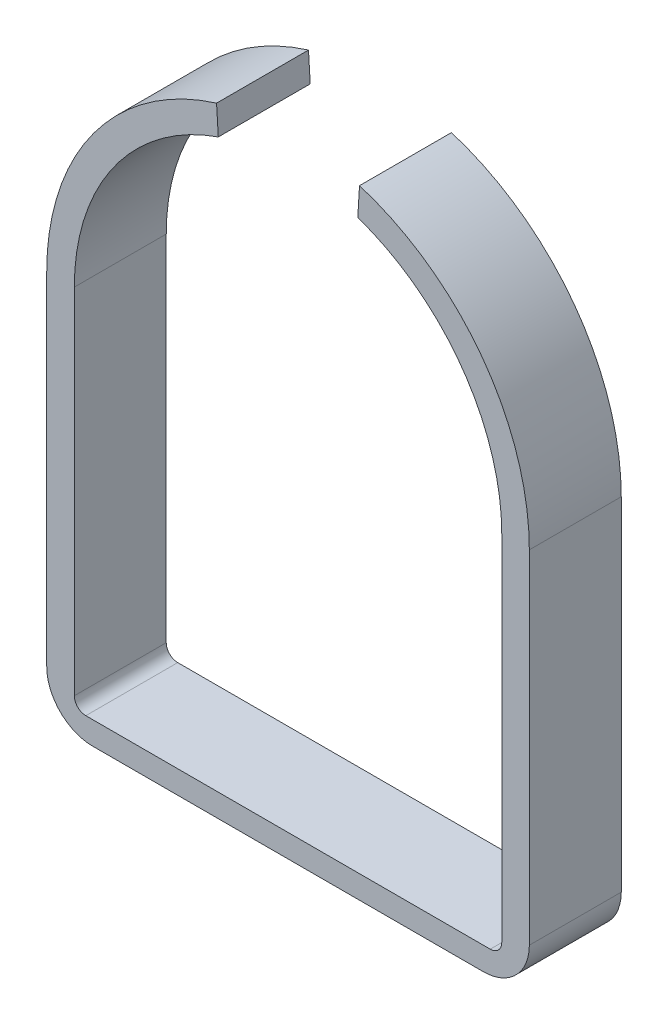
ISO-10303-21;
HEADER;
FILE_DESCRIPTION(('STEP AP214'),'2;1');
FILE_NAME('part.step','',(''),(''),'','','');
FILE_SCHEMA(('AUTOMOTIVE_DESIGN { 1 0 10303 214 1 1 1 1 }'));
ENDSEC;
DATA;
#1=APPLICATION_CONTEXT('core data for automotive mechanical design processes');
#2=APPLICATION_PROTOCOL_DEFINITION('international standard','automotive_design',2000,#1);
#3=PRODUCT_CONTEXT('',#1,'mechanical');
#4=PRODUCT('Part','Part','',(#3));
#5=PRODUCT_RELATED_PRODUCT_CATEGORY('part','',(#4));
#6=PRODUCT_DEFINITION_FORMATION('','',#4);
#7=PRODUCT_DEFINITION_CONTEXT('part definition',#1,'design');
#8=PRODUCT_DEFINITION('design','',#6,#7);
#9=PRODUCT_DEFINITION_SHAPE('','',#8);
#10=(LENGTH_UNIT() NAMED_UNIT(*) SI_UNIT(.MILLI.,.METRE.));
#11=(NAMED_UNIT(*) PLANE_ANGLE_UNIT() SI_UNIT($,.RADIAN.));
#12=(NAMED_UNIT(*) SI_UNIT($,.STERADIAN.) SOLID_ANGLE_UNIT());
#13=UNCERTAINTY_MEASURE_WITH_UNIT(LENGTH_MEASURE(1.E-05),#10,'distance_accuracy_value','');
#14=(GEOMETRIC_REPRESENTATION_CONTEXT(3) GLOBAL_UNCERTAINTY_ASSIGNED_CONTEXT((#13)) GLOBAL_UNIT_ASSIGNED_CONTEXT((#10,
#11,#12)) REPRESENTATION_CONTEXT('',''));
#15=CARTESIAN_POINT('',(0.,0.,0.));
#16=DIRECTION('',(0.,0.,1.));
#17=DIRECTION('',(1.,0.,0.));
#18=AXIS2_PLACEMENT_3D('',#15,#16,#17);
#19=CARTESIAN_POINT('',(0.,0.,56.8469714478884));
#20=DIRECTION('',(0.,0.,-1.));
#21=DIRECTION('',(-1.,0.,0.));
#22=AXIS2_PLACEMENT_3D('',#19,#20,#21);
#23=CYLINDRICAL_SURFACE('',#22,9.3);
#24=DIRECTION('',(0.,0.,-1.));
#25=VECTOR('',#24,1.);
#26=CARTESIAN_POINT('',(3.03467311666204,8.79094756411439,56.8469714478884));
#27=LINE('',#26,#25);
#28=CARTESIAN_POINT('',(3.03467311666204,8.79094756411439,1.5));
#29=VERTEX_POINT('',#28);
#30=CARTESIAN_POINT('',(3.03467311666204,8.79094756411439,5.5));
#31=VERTEX_POINT('',#30);
#32=EDGE_CURVE('E222',#29,#31,#27,.F.);
#33=ORIENTED_EDGE('',*,*,#32,.F.);
#34=CARTESIAN_POINT('',(0.,0.,1.5));
#35=DIRECTION('',(0.,0.,1.));
#36=DIRECTION('',(-1.,0.,0.));
#37=AXIS2_PLACEMENT_3D('',#34,#35,#36);
#38=CIRCLE('',#37,9.3);
#39=CARTESIAN_POINT('',(9.3,0.,1.5));
#40=VERTEX_POINT('',#39);
#41=EDGE_CURVE('E209',#40,#29,#38,.T.);
#42=ORIENTED_EDGE('',*,*,#41,.F.);
#43=DIRECTION('',(0.,0.,-1.));
#44=VECTOR('',#43,1.);
#45=CARTESIAN_POINT('',(9.3,0.,56.8469714478884));
#46=LINE('',#45,#44);
#47=CARTESIAN_POINT('',(9.3,0.,5.5));
#48=VERTEX_POINT('',#47);
#49=EDGE_CURVE('E270',#48,#40,#46,.T.);
#50=ORIENTED_EDGE('',*,*,#49,.F.);
#51=CARTESIAN_POINT('',(0.,0.,5.5));
#52=DIRECTION('',(0.,0.,1.));
#53=DIRECTION('',(1.,0.,0.));
#54=AXIS2_PLACEMENT_3D('',#51,#52,#53);
#55=CIRCLE('',#54,9.3);
#56=EDGE_CURVE('E235',#48,#31,#55,.T.);
#57=ORIENTED_EDGE('',*,*,#56,.T.);
#58=EDGE_LOOP('',(#33,#42,#50,#57));
#59=FACE_BOUND('',#58,.T.);
#60=ADVANCED_FACE('F48',(#59),#23,.F.);
#61=CARTESIAN_POINT('',(0.,0.,5.5));
#62=DIRECTION('',(0.,0.,1.));
#63=DIRECTION('',(1.,0.,0.));
#64=AXIS2_PLACEMENT_3D('',#61,#62,#63);
#65=PLANE('',#64);
#66=DIRECTION('',(0.,-1.,0.));
#67=VECTOR('',#66,1.);
#68=CARTESIAN_POINT('',(-10.5,0.,5.5));
#69=LINE('',#68,#67);
#70=CARTESIAN_POINT('',(-10.5,0.,5.5));
#71=VERTEX_POINT('',#70);
#72=CARTESIAN_POINT('',(-10.5,-14.900343897342,5.5));
#73=VERTEX_POINT('',#72);
#74=EDGE_CURVE('E178',#71,#73,#69,.T.);
#75=ORIENTED_EDGE('',*,*,#74,.T.);
#76=CARTESIAN_POINT('',(-8.5,-14.900343897342,5.5));
#77=DIRECTION('',(0.,0.,1.));
#78=DIRECTION('',(1.,0.,0.));
#79=AXIS2_PLACEMENT_3D('',#76,#77,#78);
#80=CIRCLE('',#79,2.);
#81=CARTESIAN_POINT('',(-8.5,-16.900343897342,5.5));
#82=VERTEX_POINT('',#81);
#83=EDGE_CURVE('E278',#73,#82,#80,.T.);
#84=ORIENTED_EDGE('',*,*,#83,.T.);
#85=DIRECTION('',(-1.,0.,0.));
#86=VECTOR('',#85,1.);
#87=CARTESIAN_POINT('',(-11.1726993556512,-16.900343897342,5.5));
#88=LINE('',#87,#86);
#89=CARTESIAN_POINT('',(8.5,-16.900343897342,5.5));
#90=VERTEX_POINT('',#89);
#91=EDGE_CURVE('E172',#90,#82,#88,.T.);
#92=ORIENTED_EDGE('',*,*,#91,.F.);
#93=CARTESIAN_POINT('',(8.5,-14.900343897342,5.5));
#94=DIRECTION('',(0.,0.,1.));
#95=DIRECTION('',(1.,0.,0.));
#96=AXIS2_PLACEMENT_3D('',#93,#94,#95);
#97=CIRCLE('',#96,2.);
#98=CARTESIAN_POINT('',(10.5,-14.900343897342,5.5));
#99=VERTEX_POINT('',#98);
#100=EDGE_CURVE('E276',#90,#99,#97,.T.);
#101=ORIENTED_EDGE('',*,*,#100,.T.);
#102=DIRECTION('',(0.,-1.,0.));
#103=VECTOR('',#102,1.);
#104=CARTESIAN_POINT('',(10.5,0.,5.5));
#105=LINE('',#104,#103);
#106=CARTESIAN_POINT('',(10.5,0.,5.5));
#107=VERTEX_POINT('',#106);
#108=EDGE_CURVE('E239',#107,#99,#105,.T.);
#109=ORIENTED_EDGE('',*,*,#108,.F.);
#110=CARTESIAN_POINT('',(0.,0.,5.5));
#111=DIRECTION('',(0.,0.,1.));
#112=DIRECTION('',(1.,0.,0.));
#113=AXIS2_PLACEMENT_3D('',#110,#111,#112);
#114=CIRCLE('',#113,10.5);
#115=CARTESIAN_POINT('',(3.11032664956738,10.0287520725657,5.5));
#116=VERTEX_POINT('',#115);
#117=EDGE_CURVE('E241',#116,#107,#114,.F.);
#118=ORIENTED_EDGE('',*,*,#117,.F.);
#119=DIRECTION('',(-0.0610052906976046,-0.998137442693591,0.));
#120=VECTOR('',#119,1.);
#121=CARTESIAN_POINT('',(2.48808370636675,-0.15206950796001,5.5));
#122=LINE('',#121,#120);
#123=EDGE_CURVE('E246',#116,#31,#122,.T.);
#124=ORIENTED_EDGE('',*,*,#123,.T.);
#125=ORIENTED_EDGE('',*,*,#56,.F.);
#126=DIRECTION('',(0.,1.,0.));
#127=VECTOR('',#126,1.);
#128=CARTESIAN_POINT('',(9.3,0.,5.5));
#129=LINE('',#128,#127);
#130=CARTESIAN_POINT('',(9.3,-15.4,5.5));
#131=VERTEX_POINT('',#130);
#132=EDGE_CURVE('E233',#131,#48,#129,.T.);
#133=ORIENTED_EDGE('',*,*,#132,.F.);
#134=CARTESIAN_POINT('',(8.8,-15.4,5.5));
#135=DIRECTION('',(0.,0.,1.));
#136=DIRECTION('',(1.,0.,0.));
#137=AXIS2_PLACEMENT_3D('',#134,#135,#136);
#138=CIRCLE('',#137,0.5);
#139=CARTESIAN_POINT('',(8.8,-15.9,5.5));
#140=VERTEX_POINT('',#139);
#141=EDGE_CURVE('E252',#131,#140,#138,.F.);
#142=ORIENTED_EDGE('',*,*,#141,.T.);
#143=DIRECTION('',(1.,0.,0.));
#144=VECTOR('',#143,1.);
#145=CARTESIAN_POINT('',(0.,-15.9,5.5));
#146=LINE('',#145,#144);
#147=CARTESIAN_POINT('',(-8.8,-15.9,5.5));
#148=VERTEX_POINT('',#147);
#149=EDGE_CURVE('E230',#148,#140,#146,.T.);
#150=ORIENTED_EDGE('',*,*,#149,.F.);
#151=CARTESIAN_POINT('',(-8.8,-15.4,5.5));
#152=DIRECTION('',(0.,0.,1.));
#153=DIRECTION('',(1.,0.,0.));
#154=AXIS2_PLACEMENT_3D('',#151,#152,#153);
#155=CIRCLE('',#154,0.5);
#156=CARTESIAN_POINT('',(-9.3,-15.4,5.5));
#157=VERTEX_POINT('',#156);
#158=EDGE_CURVE('E225',#148,#157,#155,.F.);
#159=ORIENTED_EDGE('',*,*,#158,.T.);
#160=DIRECTION('',(0.,-1.,0.));
#161=VECTOR('',#160,1.);
#162=CARTESIAN_POINT('',(-9.3,-15.9,5.5));
#163=LINE('',#162,#161);
#164=CARTESIAN_POINT('',(-9.3,0.,5.5));
#165=VERTEX_POINT('',#164);
#166=EDGE_CURVE('E226',#165,#157,#163,.T.);
#167=ORIENTED_EDGE('',*,*,#166,.F.);
#168=CARTESIAN_POINT('',(-3.03467311644218,8.79094756419029,5.5));
#169=VERTEX_POINT('',#168);
#170=EDGE_CURVE('E238',#169,#165,#55,.T.);
#171=ORIENTED_EDGE('',*,*,#170,.F.);
#172=DIRECTION('',(-0.0610052909139107,0.99813744268037,0.));
#173=VECTOR('',#172,1.);
#174=CARTESIAN_POINT('',(-2.48808370417207,-0.152069508367079,5.5));
#175=LINE('',#174,#173);
#176=CARTESIAN_POINT('',(-3.11032664961128,10.0287520725521,5.5));
#177=VERTEX_POINT('',#176);
#178=EDGE_CURVE('E248',#169,#177,#175,.T.);
#179=ORIENTED_EDGE('',*,*,#178,.T.);
#180=CARTESIAN_POINT('',(0.,0.,5.5));
#181=DIRECTION('',(0.,0.,1.));
#182=DIRECTION('',(1.,0.,0.));
#183=AXIS2_PLACEMENT_3D('',#180,#181,#182);
#184=CIRCLE('',#183,10.5);
#185=EDGE_CURVE('E244',#71,#177,#184,.F.);
#186=ORIENTED_EDGE('',*,*,#185,.F.);
#187=EDGE_LOOP('',(#75,#84,#92,#101,#109,#118,#124,#125,#133,#142,#150,#159,#167,#171,#179,#186));
#188=FACE_BOUND('',#187,.T.);
#189=ADVANCED_FACE('F294',(#188),#65,.T.);
#190=DIRECTION('',(0.,0.,-1.));
#191=VECTOR('',#190,1.);
#192=CARTESIAN_POINT('',(-3.03467311644218,8.79094756419029,56.8469714478884));
#193=LINE('',#192,#191);
#194=CARTESIAN_POINT('',(-3.03467311644218,8.79094756419029,1.5));
#195=VERTEX_POINT('',#194);
#196=EDGE_CURVE('E220',#169,#195,#193,.T.);
#197=ORIENTED_EDGE('',*,*,#196,.F.);
#198=ORIENTED_EDGE('',*,*,#170,.T.);
#199=DIRECTION('',(0.,0.,-1.));
#200=VECTOR('',#199,1.);
#201=CARTESIAN_POINT('',(-9.3,0.,56.8469714478884));
#202=LINE('',#201,#200);
#203=CARTESIAN_POINT('',(-9.3,0.,1.5));
#204=VERTEX_POINT('',#203);
#205=EDGE_CURVE('E182',#165,#204,#202,.T.);
#206=ORIENTED_EDGE('',*,*,#205,.T.);
#207=CARTESIAN_POINT('',(0.,0.,1.5));
#208=DIRECTION('',(0.,0.,1.));
#209=DIRECTION('',(-1.,0.,0.));
#210=AXIS2_PLACEMENT_3D('',#207,#208,#209);
#211=CIRCLE('',#210,9.3);
#212=EDGE_CURVE('E188',#195,#204,#211,.T.);
#213=ORIENTED_EDGE('',*,*,#212,.F.);
#214=EDGE_LOOP('',(#197,#198,#206,#213));
#215=FACE_BOUND('',#214,.T.);
#216=ADVANCED_FACE('F302',(#215),#23,.F.);
#217=CARTESIAN_POINT('',(-9.3,-15.9,56.8469714478884));
#218=DIRECTION('',(1.,0.,0.));
#219=DIRECTION('',(0.,0.,-1.));
#220=AXIS2_PLACEMENT_3D('',#217,#218,#219);
#221=PLANE('',#220);
#222=DIRECTION('',(0.,0.,-1.));
#223=VECTOR('',#222,1.);
#224=CARTESIAN_POINT('',(-9.3,-15.4,0.));
#225=LINE('',#224,#223);
#226=CARTESIAN_POINT('',(-9.3,-15.4,1.5));
#227=VERTEX_POINT('',#226);
#228=EDGE_CURVE('E229',#157,#227,#225,.T.);
#229=ORIENTED_EDGE('',*,*,#228,.T.);
#230=DIRECTION('',(0.,-1.,0.));
#231=VECTOR('',#230,1.);
#232=CARTESIAN_POINT('',(-9.3,0.,1.5));
#233=LINE('',#232,#231);
#234=EDGE_CURVE('E194',#204,#227,#233,.T.);
#235=ORIENTED_EDGE('',*,*,#234,.F.);
#236=ORIENTED_EDGE('',*,*,#205,.F.);
#237=ORIENTED_EDGE('',*,*,#166,.T.);
#238=EDGE_LOOP('',(#229,#235,#236,#237));
#239=FACE_BOUND('',#238,.T.);
#240=ADVANCED_FACE('F307',(#239),#221,.T.);
#241=CARTESIAN_POINT('',(0.,-15.9,56.8469714478884));
#242=DIRECTION('',(0.,1.,0.));
#243=DIRECTION('',(0.,0.,1.));
#244=AXIS2_PLACEMENT_3D('',#241,#242,#243);
#245=PLANE('',#244);
#246=DIRECTION('',(0.,0.,-1.));
#247=VECTOR('',#246,1.);
#248=CARTESIAN_POINT('',(8.8,-15.9,0.));
#249=LINE('',#248,#247);
#250=CARTESIAN_POINT('',(8.8,-15.9,1.5));
#251=VERTEX_POINT('',#250);
#252=EDGE_CURVE('E260',#140,#251,#249,.T.);
#253=ORIENTED_EDGE('',*,*,#252,.T.);
#254=DIRECTION('',(1.,0.,0.));
#255=VECTOR('',#254,1.);
#256=CARTESIAN_POINT('',(-8.8,-15.9,1.5));
#257=LINE('',#256,#255);
#258=CARTESIAN_POINT('',(-8.8,-15.9,1.5));
#259=VERTEX_POINT('',#258);
#260=EDGE_CURVE('E200',#259,#251,#257,.T.);
#261=ORIENTED_EDGE('',*,*,#260,.F.);
#262=DIRECTION('',(0.,0.,-1.));
#263=VECTOR('',#262,1.);
#264=CARTESIAN_POINT('',(-8.8,-15.9,6.02159565602451));
#265=LINE('',#264,#263);
#266=EDGE_CURVE('E262',#259,#148,#265,.F.);
#267=ORIENTED_EDGE('',*,*,#266,.T.);
#268=ORIENTED_EDGE('',*,*,#149,.T.);
#269=EDGE_LOOP('',(#253,#261,#267,#268));
#270=FACE_BOUND('',#269,.T.);
#271=ADVANCED_FACE('F314',(#270),#245,.T.);
#272=CARTESIAN_POINT('',(-8.8,-15.4,56.8469714478884));
#273=DIRECTION('',(0.,0.,1.));
#274=DIRECTION('',(1.,0.,0.));
#275=AXIS2_PLACEMENT_3D('',#272,#273,#274);
#276=CYLINDRICAL_SURFACE('',#275,0.5);
#277=ORIENTED_EDGE('',*,*,#266,.F.);
#278=CARTESIAN_POINT('',(-8.8,-15.4,1.5));
#279=DIRECTION('',(0.,0.,1.));
#280=DIRECTION('',(-1.,0.,0.));
#281=AXIS2_PLACEMENT_3D('',#278,#279,#280);
#282=CIRCLE('',#281,0.5);
#283=EDGE_CURVE('E197',#227,#259,#282,.T.);
#284=ORIENTED_EDGE('',*,*,#283,.F.);
#285=ORIENTED_EDGE('',*,*,#228,.F.);
#286=ORIENTED_EDGE('',*,*,#158,.F.);
#287=EDGE_LOOP('',(#277,#284,#285,#286));
#288=FACE_BOUND('',#287,.T.);
#289=ADVANCED_FACE('F310',(#288),#276,.F.);
#290=CARTESIAN_POINT('',(9.3,0.,56.8469714478884));
#291=DIRECTION('',(-1.,0.,0.));
#292=DIRECTION('',(0.,-1.,0.));
#293=AXIS2_PLACEMENT_3D('',#290,#291,#292);
#294=PLANE('',#293);
#295=ORIENTED_EDGE('',*,*,#49,.T.);
#296=DIRECTION('',(0.,1.,0.));
#297=VECTOR('',#296,1.);
#298=CARTESIAN_POINT('',(9.3,-15.4,1.5));
#299=LINE('',#298,#297);
#300=CARTESIAN_POINT('',(9.3,-15.4,1.5));
#301=VERTEX_POINT('',#300);
#302=EDGE_CURVE('E206',#301,#40,#299,.T.);
#303=ORIENTED_EDGE('',*,*,#302,.F.);
#304=DIRECTION('',(0.,0.,-1.));
#305=VECTOR('',#304,1.);
#306=CARTESIAN_POINT('',(9.3,-15.4,6.0215956560245));
#307=LINE('',#306,#305);
#308=EDGE_CURVE('E258',#301,#131,#307,.F.);
#309=ORIENTED_EDGE('',*,*,#308,.T.);
#310=ORIENTED_EDGE('',*,*,#132,.T.);
#311=EDGE_LOOP('',(#295,#303,#309,#310));
#312=FACE_BOUND('',#311,.T.);
#313=ADVANCED_FACE('F322',(#312),#294,.T.);
#314=CARTESIAN_POINT('',(8.8,-15.4,56.8469714478884));
#315=DIRECTION('',(0.,0.,1.));
#316=DIRECTION('',(1.,0.,0.));
#317=AXIS2_PLACEMENT_3D('',#314,#315,#316);
#318=CYLINDRICAL_SURFACE('',#317,0.5);
#319=ORIENTED_EDGE('',*,*,#308,.F.);
#320=CARTESIAN_POINT('',(8.8,-15.4,1.5));
#321=DIRECTION('',(0.,0.,1.));
#322=DIRECTION('',(-1.,0.,0.));
#323=AXIS2_PLACEMENT_3D('',#320,#321,#322);
#324=CIRCLE('',#323,0.5);
#325=EDGE_CURVE('E203',#251,#301,#324,.T.);
#326=ORIENTED_EDGE('',*,*,#325,.F.);
#327=ORIENTED_EDGE('',*,*,#252,.F.);
#328=ORIENTED_EDGE('',*,*,#141,.F.);
#329=EDGE_LOOP('',(#319,#326,#327,#328));
#330=FACE_BOUND('',#329,.T.);
#331=ADVANCED_FACE('F318',(#330),#318,.F.);
#332=CARTESIAN_POINT('',(2.48808370636675,-0.15206950796001,7.65));
#333=DIRECTION('',(0.998137442693591,-0.0610052906976046,0.));
#334=DIRECTION('',(0.0610052906976046,0.998137442693591,0.));
#335=AXIS2_PLACEMENT_3D('',#332,#333,#334);
#336=PLANE('',#335);
#337=DIRECTION('',(0.,0.,-1.));
#338=VECTOR('',#337,1.);
#339=CARTESIAN_POINT('',(3.11032664956738,10.0287520725657,7.65));
#340=LINE('',#339,#338);
#341=CARTESIAN_POINT('',(3.11032664956738,10.0287520725657,1.5));
#342=VERTEX_POINT('',#341);
#343=EDGE_CURVE('E266',#116,#342,#340,.T.);
#344=ORIENTED_EDGE('',*,*,#343,.T.);
#345=DIRECTION('',(0.0610052906976045,0.998137442693591,0.));
#346=VECTOR('',#345,1.);
#347=CARTESIAN_POINT('',(3.03467311666204,8.79094756411439,1.5));
#348=LINE('',#347,#346);
#349=EDGE_CURVE('E212',#29,#342,#348,.T.);
#350=ORIENTED_EDGE('',*,*,#349,.F.);
#351=ORIENTED_EDGE('',*,*,#32,.T.);
#352=ORIENTED_EDGE('',*,*,#123,.F.);
#353=EDGE_LOOP('',(#344,#350,#351,#352));
#354=FACE_BOUND('',#353,.T.);
#355=ADVANCED_FACE('F330',(#354),#336,.F.);
#356=CARTESIAN_POINT('',(0.,0.,7.65));
#357=DIRECTION('',(0.,0.,-1.));
#358=DIRECTION('',(-1.,0.,0.));
#359=AXIS2_PLACEMENT_3D('',#356,#357,#358);
#360=CYLINDRICAL_SURFACE('',#359,10.5);
#361=DIRECTION('',(0.,0.,-1.));
#362=VECTOR('',#361,1.);
#363=CARTESIAN_POINT('',(-3.11032664961128,10.0287520725521,7.65));
#364=LINE('',#363,#362);
#365=CARTESIAN_POINT('',(-3.11032664961128,10.0287520725521,1.5));
#366=VERTEX_POINT('',#365);
#367=EDGE_CURVE('E183',#177,#366,#364,.T.);
#368=ORIENTED_EDGE('',*,*,#367,.T.);
#369=CARTESIAN_POINT('',(0.,0.,1.5));
#370=DIRECTION('',(0.,0.,-1.));
#371=DIRECTION('',(-1.,0.,0.));
#372=AXIS2_PLACEMENT_3D('',#369,#370,#371);
#373=CIRCLE('',#372,10.5);
#374=CARTESIAN_POINT('',(-10.5,0.,1.5));
#375=VERTEX_POINT('',#374);
#376=EDGE_CURVE('E166',#375,#366,#373,.T.);
#377=ORIENTED_EDGE('',*,*,#376,.F.);
#378=DIRECTION('',(0.,0.,-1.));
#379=VECTOR('',#378,1.);
#380=CARTESIAN_POINT('',(-10.5,0.,7.65));
#381=LINE('',#380,#379);
#382=EDGE_CURVE('E175',#71,#375,#381,.T.);
#383=ORIENTED_EDGE('',*,*,#382,.F.);
#384=ORIENTED_EDGE('',*,*,#185,.T.);
#385=EDGE_LOOP('',(#368,#377,#383,#384));
#386=FACE_BOUND('',#385,.T.);
#387=ADVANCED_FACE('F185',(#386),#360,.T.);
#388=CARTESIAN_POINT('',(-10.5,0.,7.65));
#389=DIRECTION('',(1.,0.,0.));
#390=DIRECTION('',(0.,0.,-1.));
#391=AXIS2_PLACEMENT_3D('',#388,#389,#390);
#392=PLANE('',#391);
#393=DIRECTION('',(0.,1.,0.));
#394=VECTOR('',#393,1.);
#395=CARTESIAN_POINT('',(-10.5,-17.,1.5));
#396=LINE('',#395,#394);
#397=CARTESIAN_POINT('',(-10.5,-14.900343897342,1.5));
#398=VERTEX_POINT('',#397);
#399=EDGE_CURVE('E161',#398,#375,#396,.T.);
#400=ORIENTED_EDGE('',*,*,#399,.F.);
#401=DIRECTION('',(0.,0.,1.));
#402=VECTOR('',#401,1.);
#403=CARTESIAN_POINT('',(-10.5,-14.900343897342,7.65));
#404=LINE('',#403,#402);
#405=EDGE_CURVE('E274',#398,#73,#404,.T.);
#406=ORIENTED_EDGE('',*,*,#405,.T.);
#407=ORIENTED_EDGE('',*,*,#74,.F.);
#408=ORIENTED_EDGE('',*,*,#382,.T.);
#409=EDGE_LOOP('',(#400,#406,#407,#408));
#410=FACE_BOUND('',#409,.T.);
#411=ADVANCED_FACE('F176',(#410),#392,.F.);
#412=DIRECTION('',(0.,0.,-1.));
#413=VECTOR('',#412,1.);
#414=CARTESIAN_POINT('',(10.5,0.,7.65));
#415=LINE('',#414,#413);
#416=CARTESIAN_POINT('',(10.5,0.,1.5));
#417=VERTEX_POINT('',#416);
#418=EDGE_CURVE('E264',#107,#417,#415,.T.);
#419=ORIENTED_EDGE('',*,*,#418,.T.);
#420=CARTESIAN_POINT('',(0.,0.,1.5));
#421=DIRECTION('',(0.,0.,-1.));
#422=DIRECTION('',(-1.,0.,0.));
#423=AXIS2_PLACEMENT_3D('',#420,#421,#422);
#424=CIRCLE('',#423,10.5);
#425=EDGE_CURVE('E215',#342,#417,#424,.T.);
#426=ORIENTED_EDGE('',*,*,#425,.F.);
#427=ORIENTED_EDGE('',*,*,#343,.F.);
#428=ORIENTED_EDGE('',*,*,#117,.T.);
#429=EDGE_LOOP('',(#419,#426,#427,#428));
#430=FACE_BOUND('',#429,.T.);
#431=ADVANCED_FACE('F334',(#430),#360,.T.);
#432=CARTESIAN_POINT('',(10.5,0.,7.65));
#433=DIRECTION('',(1.,0.,0.));
#434=DIRECTION('',(0.,1.,0.));
#435=AXIS2_PLACEMENT_3D('',#432,#433,#434);
#436=PLANE('',#435);
#437=ORIENTED_EDGE('',*,*,#108,.T.);
#438=DIRECTION('',(0.,0.,1.));
#439=VECTOR('',#438,1.);
#440=CARTESIAN_POINT('',(10.5,-14.900343897342,1.5));
#441=LINE('',#440,#439);
#442=CARTESIAN_POINT('',(10.5,-14.900343897342,1.5));
#443=VERTEX_POINT('',#442);
#444=EDGE_CURVE('E11',#99,#443,#441,.F.);
#445=ORIENTED_EDGE('',*,*,#444,.T.);
#446=DIRECTION('',(0.,-1.,0.));
#447=VECTOR('',#446,1.);
#448=CARTESIAN_POINT('',(10.5,0.,1.5));
#449=LINE('',#448,#447);
#450=EDGE_CURVE('E218',#417,#443,#449,.T.);
#451=ORIENTED_EDGE('',*,*,#450,.F.);
#452=ORIENTED_EDGE('',*,*,#418,.F.);
#453=EDGE_LOOP('',(#437,#445,#451,#452));
#454=FACE_BOUND('',#453,.T.);
#455=ADVANCED_FACE('F336',(#454),#436,.T.);
#456=CARTESIAN_POINT('',(-2.48808370417207,-0.152069508367079,7.65));
#457=DIRECTION('',(-0.99813744268037,-0.0610052909139107,0.));
#458=DIRECTION('',(0.0610052909139107,-0.99813744268037,0.));
#459=AXIS2_PLACEMENT_3D('',#456,#457,#458);
#460=PLANE('',#459);
#461=ORIENTED_EDGE('',*,*,#178,.F.);
#462=ORIENTED_EDGE('',*,*,#196,.T.);
#463=DIRECTION('',(0.0610052909138892,-0.998137442680372,0.));
#464=VECTOR('',#463,1.);
#465=CARTESIAN_POINT('',(-3.11032664961128,10.0287520725521,1.5));
#466=LINE('',#465,#464);
#467=EDGE_CURVE('E186',#366,#195,#466,.T.);
#468=ORIENTED_EDGE('',*,*,#467,.F.);
#469=ORIENTED_EDGE('',*,*,#367,.F.);
#470=EDGE_LOOP('',(#461,#462,#468,#469));
#471=FACE_BOUND('',#470,.T.);
#472=ADVANCED_FACE('F299',(#471),#460,.F.);
#473=CARTESIAN_POINT('',(9.35000000018532,-17.0923044276493,1.5));
#474=DIRECTION('',(0.,0.,-1.));
#475=DIRECTION('',(-1.,0.,0.));
#476=AXIS2_PLACEMENT_3D('',#473,#474,#475);
#477=PLANE('',#476);
#478=DIRECTION('',(1.,0.,0.));
#479=VECTOR('',#478,1.);
#480=CARTESIAN_POINT('',(9.35000000018532,-16.900343897342,1.5));
#481=LINE('',#480,#479);
#482=CARTESIAN_POINT('',(-8.5,-16.900343897342,1.5));
#483=VERTEX_POINT('',#482);
#484=CARTESIAN_POINT('',(8.5,-16.900343897342,1.5));
#485=VERTEX_POINT('',#484);
#486=EDGE_CURVE('E272',#483,#485,#481,.T.);
#487=ORIENTED_EDGE('',*,*,#486,.F.);
#488=CARTESIAN_POINT('',(-8.5,-14.900343897342,1.5));
#489=DIRECTION('',(0.,0.,-1.));
#490=DIRECTION('',(-1.,0.,0.));
#491=AXIS2_PLACEMENT_3D('',#488,#489,#490);
#492=CIRCLE('',#491,2.);
#493=EDGE_CURVE('E56',#483,#398,#492,.T.);
#494=ORIENTED_EDGE('',*,*,#493,.T.);
#495=ORIENTED_EDGE('',*,*,#399,.T.);
#496=ORIENTED_EDGE('',*,*,#376,.T.);
#497=ORIENTED_EDGE('',*,*,#467,.T.);
#498=ORIENTED_EDGE('',*,*,#212,.T.);
#499=ORIENTED_EDGE('',*,*,#234,.T.);
#500=ORIENTED_EDGE('',*,*,#283,.T.);
#501=ORIENTED_EDGE('',*,*,#260,.T.);
#502=ORIENTED_EDGE('',*,*,#325,.T.);
#503=ORIENTED_EDGE('',*,*,#302,.T.);
#504=ORIENTED_EDGE('',*,*,#41,.T.);
#505=ORIENTED_EDGE('',*,*,#349,.T.);
#506=ORIENTED_EDGE('',*,*,#425,.T.);
#507=ORIENTED_EDGE('',*,*,#450,.T.);
#508=CARTESIAN_POINT('',(8.5,-14.900343897342,1.5));
#509=DIRECTION('',(0.,0.,-1.));
#510=DIRECTION('',(-1.,0.,0.));
#511=AXIS2_PLACEMENT_3D('',#508,#509,#510);
#512=CIRCLE('',#511,2.);
#513=EDGE_CURVE('E68',#443,#485,#512,.T.);
#514=ORIENTED_EDGE('',*,*,#513,.T.);
#515=EDGE_LOOP('',(#487,#494,#495,#496,#497,#498,#499,#500,#501,#502,#503,#504,#505,#506,#507,#514));
#516=FACE_BOUND('',#515,.T.);
#517=ADVANCED_FACE('F163',(#516),#477,.T.);
#518=CARTESIAN_POINT('',(-11.1726993556512,-16.900343897342,-4.5));
#519=DIRECTION('',(0.,1.,0.));
#520=DIRECTION('',(0.,0.,1.));
#521=AXIS2_PLACEMENT_3D('',#518,#519,#520);
#522=PLANE('',#521);
#523=ORIENTED_EDGE('',*,*,#91,.T.);
#524=DIRECTION('',(0.,0.,1.));
#525=VECTOR('',#524,1.);
#526=CARTESIAN_POINT('',(-8.5,-16.900343897342,-4.5));
#527=LINE('',#526,#525);
#528=EDGE_CURVE('E283',#82,#483,#527,.F.);
#529=ORIENTED_EDGE('',*,*,#528,.T.);
#530=ORIENTED_EDGE('',*,*,#486,.T.);
#531=DIRECTION('',(0.,0.,1.));
#532=VECTOR('',#531,1.);
#533=CARTESIAN_POINT('',(8.5,-16.900343897342,5.5));
#534=LINE('',#533,#532);
#535=EDGE_CURVE('E280',#485,#90,#534,.T.);
#536=ORIENTED_EDGE('',*,*,#535,.T.);
#537=EDGE_LOOP('',(#523,#529,#530,#536));
#538=FACE_BOUND('',#537,.T.);
#539=ADVANCED_FACE('F288',(#538),#522,.F.);
#540=CARTESIAN_POINT('',(-8.5,-14.900343897342,7.65));
#541=DIRECTION('',(0.,0.,1.));
#542=DIRECTION('',(1.,0.,0.));
#543=AXIS2_PLACEMENT_3D('',#540,#541,#542);
#544=CYLINDRICAL_SURFACE('',#543,2.);
#545=ORIENTED_EDGE('',*,*,#493,.F.);
#546=ORIENTED_EDGE('',*,*,#528,.F.);
#547=ORIENTED_EDGE('',*,*,#83,.F.);
#548=ORIENTED_EDGE('',*,*,#405,.F.);
#549=EDGE_LOOP('',(#545,#546,#547,#548));
#550=FACE_BOUND('',#549,.T.);
#551=ADVANCED_FACE('F292',(#550),#544,.T.);
#552=CARTESIAN_POINT('',(8.5,-14.900343897342,-4.5));
#553=DIRECTION('',(0.,0.,-1.));
#554=DIRECTION('',(-1.,0.,0.));
#555=AXIS2_PLACEMENT_3D('',#552,#553,#554);
#556=CYLINDRICAL_SURFACE('',#555,2.);
#557=ORIENTED_EDGE('',*,*,#513,.F.);
#558=ORIENTED_EDGE('',*,*,#444,.F.);
#559=ORIENTED_EDGE('',*,*,#100,.F.);
#560=ORIENTED_EDGE('',*,*,#535,.F.);
#561=EDGE_LOOP('',(#557,#558,#559,#560));
#562=FACE_BOUND('',#561,.T.);
#563=ADVANCED_FACE('F50',(#562),#556,.T.);
#564=CLOSED_SHELL('',(#60,#189,#216,#240,#271,#289,#313,#331,#355,#387,#411,#431,#455,#472,#517,
#539,#551,#563));
#565=MANIFOLD_SOLID_BREP('B2',#564);
#566=ADVANCED_BREP_SHAPE_REPRESENTATION('',(#18,#565),#14);
#567=SHAPE_DEFINITION_REPRESENTATION(#9,#566);
ENDSEC;
END-ISO-10303-21;
